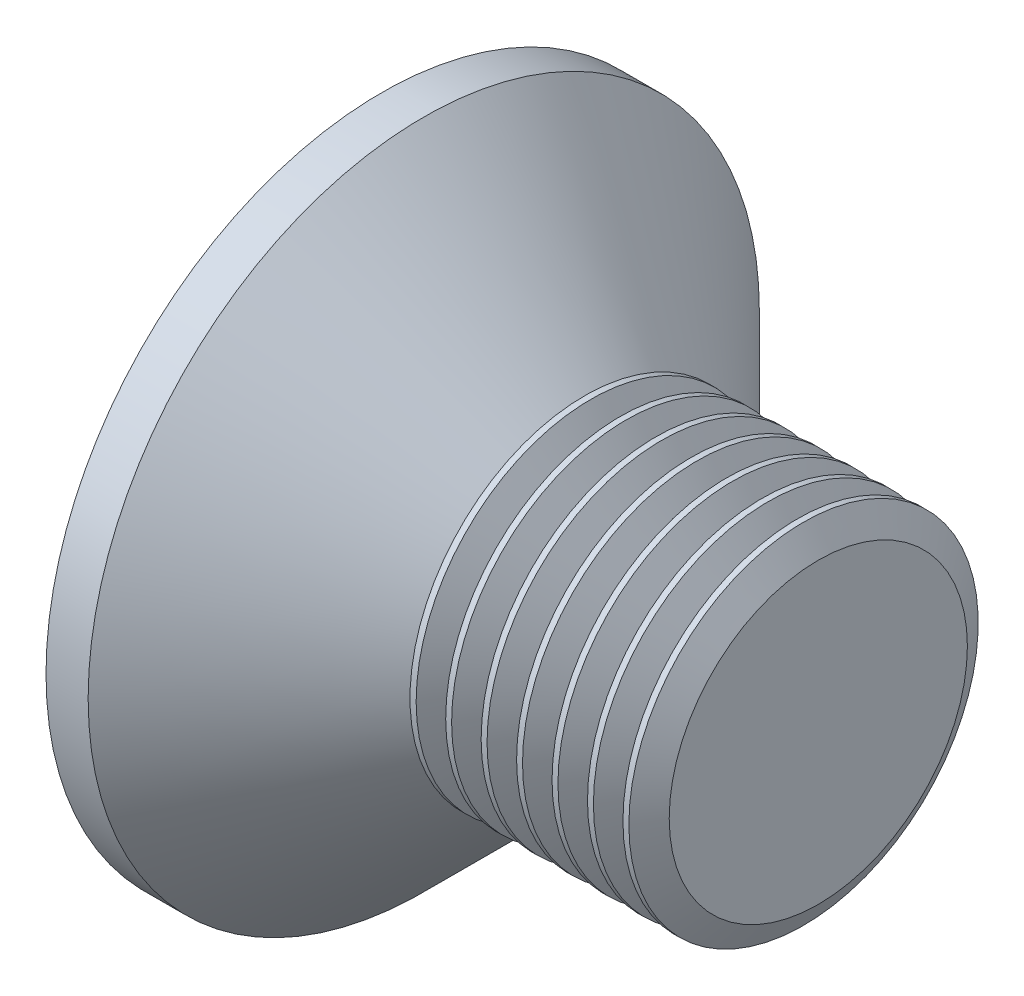
ISO-10303-21;
HEADER;
FILE_DESCRIPTION(('STEP AP214'),'2;1');
FILE_NAME('part.step','',(''),(''),'','','');
FILE_SCHEMA(('AUTOMOTIVE_DESIGN { 1 0 10303 214 1 1 1 1 }'));
ENDSEC;
DATA;
#1=APPLICATION_CONTEXT('core data for automotive mechanical design processes');
#2=APPLICATION_PROTOCOL_DEFINITION('international standard','automotive_design',2000,#1);
#3=PRODUCT_CONTEXT('',#1,'mechanical');
#4=PRODUCT('Part','Part','',(#3));
#5=PRODUCT_RELATED_PRODUCT_CATEGORY('part','',(#4));
#6=PRODUCT_DEFINITION_FORMATION('','',#4);
#7=PRODUCT_DEFINITION_CONTEXT('part definition',#1,'design');
#8=PRODUCT_DEFINITION('design','',#6,#7);
#9=PRODUCT_DEFINITION_SHAPE('','',#8);
#10=(LENGTH_UNIT() NAMED_UNIT(*) SI_UNIT(.MILLI.,.METRE.));
#11=(NAMED_UNIT(*) PLANE_ANGLE_UNIT() SI_UNIT($,.RADIAN.));
#12=(NAMED_UNIT(*) SI_UNIT($,.STERADIAN.) SOLID_ANGLE_UNIT());
#13=UNCERTAINTY_MEASURE_WITH_UNIT(LENGTH_MEASURE(1.E-05),#10,'distance_accuracy_value','');
#14=(GEOMETRIC_REPRESENTATION_CONTEXT(3) GLOBAL_UNCERTAINTY_ASSIGNED_CONTEXT((#13)) GLOBAL_UNIT_ASSIGNED_CONTEXT((#10,
#11,#12)) REPRESENTATION_CONTEXT('',''));
#15=CARTESIAN_POINT('',(0.,0.,0.));
#16=DIRECTION('',(0.,0.,1.));
#17=DIRECTION('',(1.,0.,0.));
#18=AXIS2_PLACEMENT_3D('',#15,#16,#17);
#19=CARTESIAN_POINT('',(4.51581291088132,0.,0.));
#20=DIRECTION('',(1.,0.,0.));
#21=DIRECTION('',(0.,0.,-1.));
#22=AXIS2_PLACEMENT_3D('',#19,#20,#21);
#23=CYLINDRICAL_SURFACE('',#22,3.99999999999999);
#24=CARTESIAN_POINT('',(5.60275,0.,0.));
#25=DIRECTION('',(-1.,0.,0.));
#26=DIRECTION('',(0.,0.,1.));
#27=AXIS2_PLACEMENT_3D('',#24,#25,#26);
#28=CIRCLE('',#27,4.);
#29=CARTESIAN_POINT('',(5.60275,0.,4.));
#30=VERTEX_POINT('',#29);
#31=EDGE_CURVE('E497',#30,#30,#28,.T.);
#32=ORIENTED_EDGE('',*,*,#31,.T.);
#33=EDGE_LOOP('',(#32));
#34=FACE_BOUND('',#33,.T.);
#35=CARTESIAN_POINT('',(5.46744999999999,0.,0.));
#36=DIRECTION('',(-1.,0.,0.));
#37=DIRECTION('',(0.,0.,1.));
#38=AXIS2_PLACEMENT_3D('',#35,#36,#37);
#39=CIRCLE('',#38,4.);
#40=CARTESIAN_POINT('',(5.46744999999999,0.,4.));
#41=VERTEX_POINT('',#40);
#42=EDGE_CURVE('E481',#41,#41,#39,.T.);
#43=ORIENTED_EDGE('',*,*,#42,.F.);
#44=EDGE_LOOP('',(#43));
#45=FACE_BOUND('',#44,.T.);
#46=ADVANCED_FACE('F32',(#34,#45),#23,.T.);
#47=CARTESIAN_POINT('',(6.41455,0.,0.));
#48=DIRECTION('',(-1.,0.,0.));
#49=DIRECTION('',(0.,0.,1.));
#50=AXIS2_PLACEMENT_3D('',#47,#48,#49);
#51=CIRCLE('',#50,4.);
#52=CARTESIAN_POINT('',(6.41455,0.,4.));
#53=VERTEX_POINT('',#52);
#54=EDGE_CURVE('E326',#53,#53,#51,.T.);
#55=ORIENTED_EDGE('',*,*,#54,.T.);
#56=EDGE_LOOP('',(#55));
#57=FACE_BOUND('',#56,.T.);
#58=CARTESIAN_POINT('',(6.27924999999999,0.,0.));
#59=DIRECTION('',(-1.,0.,0.));
#60=DIRECTION('',(0.,0.,1.));
#61=AXIS2_PLACEMENT_3D('',#58,#59,#60);
#62=CIRCLE('',#61,4.);
#63=CARTESIAN_POINT('',(6.27924999999999,0.,4.));
#64=VERTEX_POINT('',#63);
#65=EDGE_CURVE('E494',#64,#64,#62,.T.);
#66=ORIENTED_EDGE('',*,*,#65,.F.);
#67=EDGE_LOOP('',(#66));
#68=FACE_BOUND('',#67,.T.);
#69=ADVANCED_FACE('F239',(#57,#68),#23,.T.);
#70=CARTESIAN_POINT('',(7.22635,0.,0.));
#71=DIRECTION('',(-1.,0.,0.));
#72=DIRECTION('',(0.,0.,1.));
#73=AXIS2_PLACEMENT_3D('',#70,#71,#72);
#74=CIRCLE('',#73,4.);
#75=CARTESIAN_POINT('',(7.22635,0.,4.));
#76=VERTEX_POINT('',#75);
#77=EDGE_CURVE('E319',#76,#76,#74,.T.);
#78=ORIENTED_EDGE('',*,*,#77,.T.);
#79=EDGE_LOOP('',(#78));
#80=FACE_BOUND('',#79,.T.);
#81=CARTESIAN_POINT('',(7.09104999999999,0.,0.));
#82=DIRECTION('',(-1.,0.,0.));
#83=DIRECTION('',(0.,0.,1.));
#84=AXIS2_PLACEMENT_3D('',#81,#82,#83);
#85=CIRCLE('',#84,4.);
#86=CARTESIAN_POINT('',(7.09104999999999,0.,4.));
#87=VERTEX_POINT('',#86);
#88=EDGE_CURVE('E502',#87,#87,#85,.T.);
#89=ORIENTED_EDGE('',*,*,#88,.F.);
#90=EDGE_LOOP('',(#89));
#91=FACE_BOUND('',#90,.T.);
#92=ADVANCED_FACE('F247',(#80,#91),#23,.T.);
#93=CARTESIAN_POINT('',(8.03815,0.,0.));
#94=DIRECTION('',(-1.,0.,0.));
#95=DIRECTION('',(0.,0.,1.));
#96=AXIS2_PLACEMENT_3D('',#93,#94,#95);
#97=CIRCLE('',#96,4.);
#98=CARTESIAN_POINT('',(8.03815,0.,4.));
#99=VERTEX_POINT('',#98);
#100=EDGE_CURVE('E314',#99,#99,#97,.T.);
#101=ORIENTED_EDGE('',*,*,#100,.T.);
#102=EDGE_LOOP('',(#101));
#103=FACE_BOUND('',#102,.T.);
#104=CARTESIAN_POINT('',(7.90284999999999,0.,0.));
#105=DIRECTION('',(-1.,0.,0.));
#106=DIRECTION('',(0.,0.,1.));
#107=AXIS2_PLACEMENT_3D('',#104,#105,#106);
#108=CIRCLE('',#107,4.);
#109=CARTESIAN_POINT('',(7.90284999999999,0.,4.));
#110=VERTEX_POINT('',#109);
#111=EDGE_CURVE('E317',#110,#110,#108,.T.);
#112=ORIENTED_EDGE('',*,*,#111,.F.);
#113=EDGE_LOOP('',(#112));
#114=FACE_BOUND('',#113,.T.);
#115=ADVANCED_FACE('F285',(#103,#114),#23,.T.);
#116=CARTESIAN_POINT('',(8.03815,0.,0.));
#117=DIRECTION('',(-1.,0.,0.));
#118=DIRECTION('',(0.,0.,1.));
#119=AXIS2_PLACEMENT_3D('',#116,#117,#118);
#120=CONICAL_SURFACE('',#119,4.,1.0471975511966);
#121=CARTESIAN_POINT('',(8.37639999999999,0.,0.));
#122=DIRECTION('',(-1.,0.,0.));
#123=DIRECTION('',(0.,0.,1.));
#124=AXIS2_PLACEMENT_3D('',#121,#122,#123);
#125=CIRCLE('',#124,3.41413381433983);
#126=CARTESIAN_POINT('',(8.37639999999999,0.,3.41413381433983));
#127=VERTEX_POINT('',#126);
#128=EDGE_CURVE('E323',#127,#127,#125,.T.);
#129=ORIENTED_EDGE('',*,*,#128,.T.);
#130=EDGE_LOOP('',(#129));
#131=FACE_BOUND('',#130,.T.);
#132=ORIENTED_EDGE('',*,*,#100,.F.);
#133=EDGE_LOOP('',(#132));
#134=FACE_BOUND('',#133,.T.);
#135=ADVANCED_FACE('F300',(#131,#134),#120,.T.);
#136=CARTESIAN_POINT('',(8.37639999999999,0.,0.));
#137=DIRECTION('',(1.,0.,0.));
#138=DIRECTION('',(0.,0.,-1.));
#139=AXIS2_PLACEMENT_3D('',#136,#137,#138);
#140=CONICAL_SURFACE('',#139,3.41413381433983,1.0471975511966);
#141=CARTESIAN_POINT('',(8.71464999999999,0.,0.));
#142=DIRECTION('',(-1.,0.,0.));
#143=DIRECTION('',(0.,0.,1.));
#144=AXIS2_PLACEMENT_3D('',#141,#142,#143);
#145=CIRCLE('',#144,4.);
#146=CARTESIAN_POINT('',(8.71464999999999,0.,4.));
#147=VERTEX_POINT('',#146);
#148=EDGE_CURVE('E332',#147,#147,#145,.T.);
#149=ORIENTED_EDGE('',*,*,#148,.T.);
#150=EDGE_LOOP('',(#149));
#151=FACE_BOUND('',#150,.T.);
#152=ORIENTED_EDGE('',*,*,#128,.F.);
#153=EDGE_LOOP('',(#152));
#154=FACE_BOUND('',#153,.T.);
#155=ADVANCED_FACE('F307',(#151,#154),#140,.T.);
#156=CARTESIAN_POINT('',(10.,3.99999999999999,0.));
#157=DIRECTION('',(1.,0.,0.));
#158=DIRECTION('',(0.,0.,-1.));
#159=AXIS2_PLACEMENT_3D('',#156,#157,#158);
#160=PLANE('',#159);
#161=CARTESIAN_POINT('',(9.99999999999999,0.,0.));
#162=DIRECTION('',(-1.,0.,0.));
#163=DIRECTION('',(0.,0.,1.));
#164=AXIS2_PLACEMENT_3D('',#161,#162,#163);
#165=CIRCLE('',#164,3.41413381433983);
#166=CARTESIAN_POINT('',(9.99999999999999,0.,3.41413381433983));
#167=VERTEX_POINT('',#166);
#168=EDGE_CURVE('E344',#167,#167,#165,.T.);
#169=ORIENTED_EDGE('',*,*,#168,.F.);
#170=EDGE_LOOP('',(#169));
#171=FACE_BOUND('',#170,.T.);
#172=ADVANCED_FACE('F277',(#171),#160,.T.);
#173=CARTESIAN_POINT('',(9.66175,0.,0.));
#174=DIRECTION('',(-1.,0.,0.));
#175=DIRECTION('',(0.,0.,1.));
#176=AXIS2_PLACEMENT_3D('',#173,#174,#175);
#177=CONICAL_SURFACE('',#176,4.,1.0471975511966);
#178=ORIENTED_EDGE('',*,*,#168,.T.);
#179=EDGE_LOOP('',(#178));
#180=FACE_BOUND('',#179,.T.);
#181=CARTESIAN_POINT('',(9.66175,0.,0.));
#182=DIRECTION('',(-1.,0.,0.));
#183=DIRECTION('',(0.,0.,1.));
#184=AXIS2_PLACEMENT_3D('',#181,#182,#183);
#185=CIRCLE('',#184,4.);
#186=CARTESIAN_POINT('',(9.66175,0.,4.));
#187=VERTEX_POINT('',#186);
#188=EDGE_CURVE('E156',#187,#187,#185,.T.);
#189=ORIENTED_EDGE('',*,*,#188,.F.);
#190=EDGE_LOOP('',(#189));
#191=FACE_BOUND('',#190,.T.);
#192=ADVANCED_FACE('F265',(#180,#191),#177,.T.);
#193=ORIENTED_EDGE('',*,*,#188,.T.);
#194=EDGE_LOOP('',(#193));
#195=FACE_BOUND('',#194,.T.);
#196=CARTESIAN_POINT('',(9.52644999999999,0.,0.));
#197=DIRECTION('',(-1.,0.,0.));
#198=DIRECTION('',(0.,0.,1.));
#199=AXIS2_PLACEMENT_3D('',#196,#197,#198);
#200=CIRCLE('',#199,4.);
#201=CARTESIAN_POINT('',(9.52644999999999,0.,4.));
#202=VERTEX_POINT('',#201);
#203=EDGE_CURVE('E339',#202,#202,#200,.T.);
#204=ORIENTED_EDGE('',*,*,#203,.F.);
#205=EDGE_LOOP('',(#204));
#206=FACE_BOUND('',#205,.T.);
#207=ADVANCED_FACE('F255',(#195,#206),#23,.T.);
#208=CARTESIAN_POINT('',(9.18819999999999,0.,0.));
#209=DIRECTION('',(1.,0.,0.));
#210=DIRECTION('',(0.,0.,-1.));
#211=AXIS2_PLACEMENT_3D('',#208,#209,#210);
#212=CONICAL_SURFACE('',#211,3.41413381433983,1.0471975511966);
#213=ORIENTED_EDGE('',*,*,#203,.T.);
#214=EDGE_LOOP('',(#213));
#215=FACE_BOUND('',#214,.T.);
#216=CARTESIAN_POINT('',(9.18819999999999,0.,0.));
#217=DIRECTION('',(-1.,0.,0.));
#218=DIRECTION('',(0.,0.,1.));
#219=AXIS2_PLACEMENT_3D('',#216,#217,#218);
#220=CIRCLE('',#219,3.41413381433983);
#221=CARTESIAN_POINT('',(9.18819999999999,0.,3.41413381433983));
#222=VERTEX_POINT('',#221);
#223=EDGE_CURVE('E336',#222,#222,#220,.T.);
#224=ORIENTED_EDGE('',*,*,#223,.F.);
#225=EDGE_LOOP('',(#224));
#226=FACE_BOUND('',#225,.T.);
#227=ADVANCED_FACE('F264',(#215,#226),#212,.T.);
#228=CARTESIAN_POINT('',(8.84995,0.,0.));
#229=DIRECTION('',(-1.,0.,0.));
#230=DIRECTION('',(0.,0.,1.));
#231=AXIS2_PLACEMENT_3D('',#228,#229,#230);
#232=CONICAL_SURFACE('',#231,4.,1.0471975511966);
#233=ORIENTED_EDGE('',*,*,#223,.T.);
#234=EDGE_LOOP('',(#233));
#235=FACE_BOUND('',#234,.T.);
#236=CARTESIAN_POINT('',(8.84995,0.,0.));
#237=DIRECTION('',(-1.,0.,0.));
#238=DIRECTION('',(0.,0.,1.));
#239=AXIS2_PLACEMENT_3D('',#236,#237,#238);
#240=CIRCLE('',#239,4.);
#241=CARTESIAN_POINT('',(8.84995,0.,4.));
#242=VERTEX_POINT('',#241);
#243=EDGE_CURVE('E342',#242,#242,#240,.T.);
#244=ORIENTED_EDGE('',*,*,#243,.F.);
#245=EDGE_LOOP('',(#244));
#246=FACE_BOUND('',#245,.T.);
#247=ADVANCED_FACE('F273',(#235,#246),#232,.T.);
#248=ORIENTED_EDGE('',*,*,#243,.T.);
#249=EDGE_LOOP('',(#248));
#250=FACE_BOUND('',#249,.T.);
#251=ORIENTED_EDGE('',*,*,#148,.F.);
#252=EDGE_LOOP('',(#251));
#253=FACE_BOUND('',#252,.T.);
#254=ADVANCED_FACE('F267',(#250,#253),#23,.T.);
#255=CARTESIAN_POINT('',(7.22635,0.,0.));
#256=DIRECTION('',(-1.,0.,0.));
#257=DIRECTION('',(0.,0.,1.));
#258=AXIS2_PLACEMENT_3D('',#255,#256,#257);
#259=CONICAL_SURFACE('',#258,4.,1.0471975511966);
#260=CARTESIAN_POINT('',(7.5646,0.,0.));
#261=DIRECTION('',(-1.,0.,0.));
#262=DIRECTION('',(0.,0.,1.));
#263=AXIS2_PLACEMENT_3D('',#260,#261,#262);
#264=CIRCLE('',#263,3.41413381433983);
#265=CARTESIAN_POINT('',(7.5646,0.,3.41413381433983));
#266=VERTEX_POINT('',#265);
#267=EDGE_CURVE('E320',#266,#266,#264,.T.);
#268=ORIENTED_EDGE('',*,*,#267,.T.);
#269=EDGE_LOOP('',(#268));
#270=FACE_BOUND('',#269,.T.);
#271=ORIENTED_EDGE('',*,*,#77,.F.);
#272=EDGE_LOOP('',(#271));
#273=FACE_BOUND('',#272,.T.);
#274=ADVANCED_FACE('F283',(#270,#273),#259,.T.);
#275=CARTESIAN_POINT('',(7.5646,0.,0.));
#276=DIRECTION('',(1.,0.,0.));
#277=DIRECTION('',(0.,0.,-1.));
#278=AXIS2_PLACEMENT_3D('',#275,#276,#277);
#279=CONICAL_SURFACE('',#278,3.41413381433983,1.0471975511966);
#280=ORIENTED_EDGE('',*,*,#111,.T.);
#281=EDGE_LOOP('',(#280));
#282=FACE_BOUND('',#281,.T.);
#283=ORIENTED_EDGE('',*,*,#267,.F.);
#284=EDGE_LOOP('',(#283));
#285=FACE_BOUND('',#284,.T.);
#286=ADVANCED_FACE('F291',(#282,#285),#279,.T.);
#287=CARTESIAN_POINT('',(6.41455,0.,0.));
#288=DIRECTION('',(-1.,0.,0.));
#289=DIRECTION('',(0.,0.,1.));
#290=AXIS2_PLACEMENT_3D('',#287,#288,#289);
#291=CONICAL_SURFACE('',#290,4.,1.0471975511966);
#292=CARTESIAN_POINT('',(6.7528,0.,0.));
#293=DIRECTION('',(-1.,0.,0.));
#294=DIRECTION('',(0.,0.,1.));
#295=AXIS2_PLACEMENT_3D('',#292,#293,#294);
#296=CIRCLE('',#295,3.41413381433983);
#297=CARTESIAN_POINT('',(6.7528,0.,3.41413381433983));
#298=VERTEX_POINT('',#297);
#299=EDGE_CURVE('E499',#298,#298,#296,.T.);
#300=ORIENTED_EDGE('',*,*,#299,.T.);
#301=EDGE_LOOP('',(#300));
#302=FACE_BOUND('',#301,.T.);
#303=ORIENTED_EDGE('',*,*,#54,.F.);
#304=EDGE_LOOP('',(#303));
#305=FACE_BOUND('',#304,.T.);
#306=ADVANCED_FACE('F455',(#302,#305),#291,.T.);
#307=CARTESIAN_POINT('',(6.7528,0.,0.));
#308=DIRECTION('',(1.,0.,0.));
#309=DIRECTION('',(0.,0.,-1.));
#310=AXIS2_PLACEMENT_3D('',#307,#308,#309);
#311=CONICAL_SURFACE('',#310,3.41413381433983,1.0471975511966);
#312=ORIENTED_EDGE('',*,*,#88,.T.);
#313=EDGE_LOOP('',(#312));
#314=FACE_BOUND('',#313,.T.);
#315=ORIENTED_EDGE('',*,*,#299,.F.);
#316=EDGE_LOOP('',(#315));
#317=FACE_BOUND('',#316,.T.);
#318=ADVANCED_FACE('F458',(#314,#317),#311,.T.);
#319=CARTESIAN_POINT('',(5.60275,0.,0.));
#320=DIRECTION('',(-1.,0.,0.));
#321=DIRECTION('',(0.,0.,1.));
#322=AXIS2_PLACEMENT_3D('',#319,#320,#321);
#323=CONICAL_SURFACE('',#322,4.,1.0471975511966);
#324=CARTESIAN_POINT('',(5.941,0.,0.));
#325=DIRECTION('',(-1.,0.,0.));
#326=DIRECTION('',(0.,0.,1.));
#327=AXIS2_PLACEMENT_3D('',#324,#325,#326);
#328=CIRCLE('',#327,3.41413381433983);
#329=CARTESIAN_POINT('',(5.941,0.,3.41413381433983));
#330=VERTEX_POINT('',#329);
#331=EDGE_CURVE('E491',#330,#330,#328,.T.);
#332=ORIENTED_EDGE('',*,*,#331,.T.);
#333=EDGE_LOOP('',(#332));
#334=FACE_BOUND('',#333,.T.);
#335=ORIENTED_EDGE('',*,*,#31,.F.);
#336=EDGE_LOOP('',(#335));
#337=FACE_BOUND('',#336,.T.);
#338=ADVANCED_FACE('F462',(#334,#337),#323,.T.);
#339=CARTESIAN_POINT('',(5.941,0.,0.));
#340=DIRECTION('',(1.,0.,0.));
#341=DIRECTION('',(0.,0.,-1.));
#342=AXIS2_PLACEMENT_3D('',#339,#340,#341);
#343=CONICAL_SURFACE('',#342,3.41413381433983,1.0471975511966);
#344=ORIENTED_EDGE('',*,*,#65,.T.);
#345=EDGE_LOOP('',(#344));
#346=FACE_BOUND('',#345,.T.);
#347=ORIENTED_EDGE('',*,*,#331,.F.);
#348=EDGE_LOOP('',(#347));
#349=FACE_BOUND('',#348,.T.);
#350=ADVANCED_FACE('F466',(#346,#349),#343,.T.);
#351=CARTESIAN_POINT('',(4.79095,0.,0.));
#352=DIRECTION('',(-1.,0.,0.));
#353=DIRECTION('',(0.,0.,1.));
#354=AXIS2_PLACEMENT_3D('',#351,#352,#353);
#355=CONICAL_SURFACE('',#354,4.,1.0471975511966);
#356=CARTESIAN_POINT('',(5.1292,0.,0.));
#357=DIRECTION('',(-1.,0.,0.));
#358=DIRECTION('',(0.,0.,1.));
#359=AXIS2_PLACEMENT_3D('',#356,#357,#358);
#360=CIRCLE('',#359,3.41413381433983);
#361=CARTESIAN_POINT('',(5.1292,0.,3.41413381433983));
#362=VERTEX_POINT('',#361);
#363=EDGE_CURVE('E484',#362,#362,#360,.T.);
#364=ORIENTED_EDGE('',*,*,#363,.T.);
#365=EDGE_LOOP('',(#364));
#366=FACE_BOUND('',#365,.T.);
#367=CARTESIAN_POINT('',(4.79095,0.,0.));
#368=DIRECTION('',(-1.,0.,0.));
#369=DIRECTION('',(0.,0.,1.));
#370=AXIS2_PLACEMENT_3D('',#367,#368,#369);
#371=CIRCLE('',#370,4.);
#372=CARTESIAN_POINT('',(4.79095,0.,4.));
#373=VERTEX_POINT('',#372);
#374=EDGE_CURVE('E486',#373,#373,#371,.T.);
#375=ORIENTED_EDGE('',*,*,#374,.F.);
#376=EDGE_LOOP('',(#375));
#377=FACE_BOUND('',#376,.T.);
#378=ADVANCED_FACE('F470',(#366,#377),#355,.T.);
#379=CARTESIAN_POINT('',(5.1292,0.,0.));
#380=DIRECTION('',(1.,0.,0.));
#381=DIRECTION('',(0.,0.,-1.));
#382=AXIS2_PLACEMENT_3D('',#379,#380,#381);
#383=CONICAL_SURFACE('',#382,3.41413381433983,1.0471975511966);
#384=ORIENTED_EDGE('',*,*,#42,.T.);
#385=EDGE_LOOP('',(#384));
#386=FACE_BOUND('',#385,.T.);
#387=ORIENTED_EDGE('',*,*,#363,.F.);
#388=EDGE_LOOP('',(#387));
#389=FACE_BOUND('',#388,.T.);
#390=ADVANCED_FACE('F448',(#386,#389),#383,.T.);
#391=CARTESIAN_POINT('',(2.325,0.89,0.89));
#392=DIRECTION('',(1.,0.,0.));
#393=DIRECTION('',(0.,0.,-1.));
#394=AXIS2_PLACEMENT_3D('',#391,#392,#393);
#395=PLANE('',#394);
#396=DIRECTION('',(0.,0.,1.));
#397=VECTOR('',#396,1.);
#398=CARTESIAN_POINT('',(2.325,0.89,0.89));
#399=LINE('',#398,#397);
#400=CARTESIAN_POINT('',(2.325,0.89,1.19));
#401=VERTEX_POINT('',#400);
#402=CARTESIAN_POINT('',(2.325,0.889999999999999,3.10766062413412));
#403=VERTEX_POINT('',#402);
#404=EDGE_CURVE('E169',#401,#403,#399,.T.);
#405=ORIENTED_EDGE('',*,*,#404,.F.);
#406=CARTESIAN_POINT('',(2.325,1.19,1.19));
#407=DIRECTION('',(1.,0.,0.));
#408=DIRECTION('',(0.,0.,-1.));
#409=AXIS2_PLACEMENT_3D('',#406,#407,#408);
#410=CIRCLE('',#409,0.3);
#411=CARTESIAN_POINT('',(2.325,1.19,0.89));
#412=VERTEX_POINT('',#411);
#413=EDGE_CURVE('E40',#401,#412,#410,.T.);
#414=ORIENTED_EDGE('',*,*,#413,.T.);
#415=DIRECTION('',(0.,-1.,0.));
#416=VECTOR('',#415,1.);
#417=CARTESIAN_POINT('',(2.325,0.89,0.89));
#418=LINE('',#417,#416);
#419=CARTESIAN_POINT('',(2.325,3.10766062413412,0.89));
#420=VERTEX_POINT('',#419);
#421=EDGE_CURVE('E216',#420,#412,#418,.T.);
#422=ORIENTED_EDGE('',*,*,#421,.F.);
#423=DIRECTION('',(0.,0.,1.));
#424=VECTOR('',#423,1.);
#425=CARTESIAN_POINT('',(2.325,3.10766062413412,-0.89));
#426=LINE('',#425,#424);
#427=CARTESIAN_POINT('',(2.325,3.10766062413412,-0.89));
#428=VERTEX_POINT('',#427);
#429=EDGE_CURVE('E224',#428,#420,#426,.T.);
#430=ORIENTED_EDGE('',*,*,#429,.F.);
#431=DIRECTION('',(0.,1.,0.));
#432=VECTOR('',#431,1.);
#433=CARTESIAN_POINT('',(2.325,0.89,-0.89));
#434=LINE('',#433,#432);
#435=CARTESIAN_POINT('',(2.325,1.19,-0.89));
#436=VERTEX_POINT('',#435);
#437=EDGE_CURVE('E364',#436,#428,#434,.T.);
#438=ORIENTED_EDGE('',*,*,#437,.F.);
#439=CARTESIAN_POINT('',(2.325,1.19,-1.19));
#440=DIRECTION('',(1.,0.,0.));
#441=DIRECTION('',(0.,0.,-1.));
#442=AXIS2_PLACEMENT_3D('',#439,#440,#441);
#443=CIRCLE('',#442,0.3);
#444=CARTESIAN_POINT('',(2.325,0.89,-1.19));
#445=VERTEX_POINT('',#444);
#446=EDGE_CURVE('E210',#436,#445,#443,.T.);
#447=ORIENTED_EDGE('',*,*,#446,.T.);
#448=DIRECTION('',(0.,0.,1.));
#449=VECTOR('',#448,1.);
#450=CARTESIAN_POINT('',(2.325,0.89,-0.89));
#451=LINE('',#450,#449);
#452=CARTESIAN_POINT('',(2.325,0.89,-3.10766062413412));
#453=VERTEX_POINT('',#452);
#454=EDGE_CURVE('E361',#453,#445,#451,.T.);
#455=ORIENTED_EDGE('',*,*,#454,.F.);
#456=DIRECTION('',(0.,1.,0.));
#457=VECTOR('',#456,1.);
#458=CARTESIAN_POINT('',(2.325,0.89,-3.10766062413412));
#459=LINE('',#458,#457);
#460=CARTESIAN_POINT('',(2.325,-0.89,-3.10766062413412));
#461=VERTEX_POINT('',#460);
#462=EDGE_CURVE('E360',#461,#453,#459,.T.);
#463=ORIENTED_EDGE('',*,*,#462,.F.);
#464=DIRECTION('',(0.,0.,-1.));
#465=VECTOR('',#464,1.);
#466=CARTESIAN_POINT('',(2.325,-0.89,-0.89));
#467=LINE('',#466,#465);
#468=CARTESIAN_POINT('',(2.325,-0.89,-1.19));
#469=VERTEX_POINT('',#468);
#470=EDGE_CURVE('E358',#469,#461,#467,.T.);
#471=ORIENTED_EDGE('',*,*,#470,.F.);
#472=CARTESIAN_POINT('',(2.325,-1.19,-1.19));
#473=DIRECTION('',(1.,0.,0.));
#474=DIRECTION('',(0.,0.,-1.));
#475=AXIS2_PLACEMENT_3D('',#472,#473,#474);
#476=CIRCLE('',#475,0.3);
#477=CARTESIAN_POINT('',(2.325,-1.19,-0.89));
#478=VERTEX_POINT('',#477);
#479=EDGE_CURVE('E208',#469,#478,#476,.T.);
#480=ORIENTED_EDGE('',*,*,#479,.T.);
#481=DIRECTION('',(0.,1.,0.));
#482=VECTOR('',#481,1.);
#483=CARTESIAN_POINT('',(2.325,-0.89,-0.89));
#484=LINE('',#483,#482);
#485=CARTESIAN_POINT('',(2.325,-3.10766062413412,-0.89));
#486=VERTEX_POINT('',#485);
#487=EDGE_CURVE('E355',#486,#478,#484,.T.);
#488=ORIENTED_EDGE('',*,*,#487,.F.);
#489=DIRECTION('',(0.,0.,-1.));
#490=VECTOR('',#489,1.);
#491=CARTESIAN_POINT('',(2.325,-3.10766062413412,-0.89));
#492=LINE('',#491,#490);
#493=CARTESIAN_POINT('',(2.325,-3.10766062413412,0.889999999999999));
#494=VERTEX_POINT('',#493);
#495=EDGE_CURVE('E354',#494,#486,#492,.T.);
#496=ORIENTED_EDGE('',*,*,#495,.F.);
#497=DIRECTION('',(0.,-1.,0.));
#498=VECTOR('',#497,1.);
#499=CARTESIAN_POINT('',(2.325,-0.89,0.89));
#500=LINE('',#499,#498);
#501=CARTESIAN_POINT('',(2.325,-1.19,0.889999999999999));
#502=VERTEX_POINT('',#501);
#503=EDGE_CURVE('E352',#502,#494,#500,.T.);
#504=ORIENTED_EDGE('',*,*,#503,.F.);
#505=CARTESIAN_POINT('',(2.325,-1.19,1.19));
#506=DIRECTION('',(1.,0.,0.));
#507=DIRECTION('',(0.,0.,-1.));
#508=AXIS2_PLACEMENT_3D('',#505,#506,#507);
#509=CIRCLE('',#508,0.3);
#510=CARTESIAN_POINT('',(2.325,-0.89,1.19));
#511=VERTEX_POINT('',#510);
#512=EDGE_CURVE('E11',#502,#511,#509,.T.);
#513=ORIENTED_EDGE('',*,*,#512,.T.);
#514=DIRECTION('',(0.,0.,-1.));
#515=VECTOR('',#514,1.);
#516=CARTESIAN_POINT('',(2.325,-0.89,0.89));
#517=LINE('',#516,#515);
#518=CARTESIAN_POINT('',(2.325,-0.890000000000001,3.10766062413412));
#519=VERTEX_POINT('',#518);
#520=EDGE_CURVE('E350',#519,#511,#517,.T.);
#521=ORIENTED_EDGE('',*,*,#520,.F.);
#522=DIRECTION('',(0.,-1.,0.));
#523=VECTOR('',#522,1.);
#524=CARTESIAN_POINT('',(2.325,0.889999999999999,3.10766062413412));
#525=LINE('',#524,#523);
#526=EDGE_CURVE('E180',#403,#519,#525,.T.);
#527=ORIENTED_EDGE('',*,*,#526,.F.);
#528=EDGE_LOOP('',(#405,#414,#422,#430,#438,#447,#455,#463,#471,#480,#488,#496,#504,#513,#521,#527));
#529=FACE_BOUND('',#528,.T.);
#530=ADVANCED_FACE('F214',(#529),#395,.F.);
#531=CARTESIAN_POINT('',(0.,-4.45,-0.89));
#532=DIRECTION('',(-0.500000000000001,0.866025403784438,0.));
#533=DIRECTION('',(-0.866025403784438,-0.500000000000001,0.));
#534=AXIS2_PLACEMENT_3D('',#531,#532,#533);
#535=PLANE('',#534);
#536=DIRECTION('',(0.,0.,-1.));
#537=VECTOR('',#536,1.);
#538=CARTESIAN_POINT('',(0.,-4.45,-0.89));
#539=LINE('',#538,#537);
#540=CARTESIAN_POINT('',(0.,-4.45,0.889999999999999));
#541=VERTEX_POINT('',#540);
#542=CARTESIAN_POINT('',(0.,-4.45,-0.89));
#543=VERTEX_POINT('',#542);
#544=EDGE_CURVE('E369',#541,#543,#539,.T.);
#545=ORIENTED_EDGE('',*,*,#544,.F.);
#546=DIRECTION('',(-0.866025403784438,-0.500000000000001,0.));
#547=VECTOR('',#546,1.);
#548=CARTESIAN_POINT('',(0.,-4.45,0.889999999999999));
#549=LINE('',#548,#547);
#550=EDGE_CURVE('E176',#494,#541,#549,.T.);
#551=ORIENTED_EDGE('',*,*,#550,.F.);
#552=ORIENTED_EDGE('',*,*,#495,.T.);
#553=DIRECTION('',(-0.866025403784438,-0.500000000000001,0.));
#554=VECTOR('',#553,1.);
#555=CARTESIAN_POINT('',(3.2852752187363,-2.55324546810058,-0.89));
#556=LINE('',#555,#554);
#557=EDGE_CURVE('E403',#486,#543,#556,.T.);
#558=ORIENTED_EDGE('',*,*,#557,.T.);
#559=EDGE_LOOP('',(#545,#551,#552,#558));
#560=FACE_BOUND('',#559,.T.);
#561=ADVANCED_FACE('F412',(#560),#535,.T.);
#562=CARTESIAN_POINT('',(2.325,-0.89,0.89));
#563=DIRECTION('',(0.,0.,-1.));
#564=DIRECTION('',(0.,1.,0.));
#565=AXIS2_PLACEMENT_3D('',#562,#563,#564);
#566=PLANE('',#565);
#567=DIRECTION('',(0.,-1.,0.));
#568=VECTOR('',#567,1.);
#569=CARTESIAN_POINT('',(0.,-0.89,0.89));
#570=LINE('',#569,#568);
#571=CARTESIAN_POINT('',(0.,-1.19,0.889999999999999));
#572=VERTEX_POINT('',#571);
#573=EDGE_CURVE('E367',#572,#541,#570,.T.);
#574=ORIENTED_EDGE('',*,*,#573,.F.);
#575=DIRECTION('',(-1.,0.,0.));
#576=VECTOR('',#575,1.);
#577=CARTESIAN_POINT('',(2.325,-1.19,0.889999999999999));
#578=LINE('',#577,#576);
#579=EDGE_CURVE('E47',#572,#502,#578,.F.);
#580=ORIENTED_EDGE('',*,*,#579,.T.);
#581=ORIENTED_EDGE('',*,*,#503,.T.);
#582=ORIENTED_EDGE('',*,*,#550,.T.);
#583=EDGE_LOOP('',(#574,#580,#581,#582));
#584=FACE_BOUND('',#583,.T.);
#585=ADVANCED_FACE('F409',(#584),#566,.T.);
#586=CARTESIAN_POINT('',(2.325,-1.19,1.19));
#587=DIRECTION('',(-1.,0.,0.));
#588=DIRECTION('',(0.,0.,1.));
#589=AXIS2_PLACEMENT_3D('',#586,#587,#588);
#590=CYLINDRICAL_SURFACE('',#589,0.3);
#591=ORIENTED_EDGE('',*,*,#512,.F.);
#592=ORIENTED_EDGE('',*,*,#579,.F.);
#593=CARTESIAN_POINT('',(0.,-1.19,1.19));
#594=DIRECTION('',(-1.,0.,0.));
#595=DIRECTION('',(0.,0.,1.));
#596=AXIS2_PLACEMENT_3D('',#593,#594,#595);
#597=CIRCLE('',#596,0.3);
#598=CARTESIAN_POINT('',(0.,-0.89,1.19));
#599=VERTEX_POINT('',#598);
#600=EDGE_CURVE('E184',#599,#572,#597,.T.);
#601=ORIENTED_EDGE('',*,*,#600,.F.);
#602=DIRECTION('',(-1.,0.,0.));
#603=VECTOR('',#602,1.);
#604=CARTESIAN_POINT('',(2.325,-0.89,1.19));
#605=LINE('',#604,#603);
#606=EDGE_CURVE('E204',#511,#599,#605,.T.);
#607=ORIENTED_EDGE('',*,*,#606,.F.);
#608=EDGE_LOOP('',(#591,#592,#601,#607));
#609=FACE_BOUND('',#608,.T.);
#610=ADVANCED_FACE('F34',(#609),#590,.T.);
#611=CARTESIAN_POINT('',(2.325,-0.89,0.89));
#612=DIRECTION('',(0.,1.,0.));
#613=DIRECTION('',(0.,0.,1.));
#614=AXIS2_PLACEMENT_3D('',#611,#612,#613);
#615=PLANE('',#614);
#616=ORIENTED_EDGE('',*,*,#520,.T.);
#617=ORIENTED_EDGE('',*,*,#606,.T.);
#618=DIRECTION('',(0.,0.,-1.));
#619=VECTOR('',#618,1.);
#620=CARTESIAN_POINT('',(0.,-0.89,0.89));
#621=LINE('',#620,#619);
#622=CARTESIAN_POINT('',(0.,-0.890000000000001,4.45));
#623=VERTEX_POINT('',#622);
#624=EDGE_CURVE('E165',#623,#599,#621,.T.);
#625=ORIENTED_EDGE('',*,*,#624,.F.);
#626=DIRECTION('',(-0.866025403784438,0.,0.500000000000001));
#627=VECTOR('',#626,1.);
#628=CARTESIAN_POINT('',(3.2852752187363,-0.890000000000001,2.55324546810059));
#629=LINE('',#628,#627);
#630=EDGE_CURVE('E163',#519,#623,#629,.T.);
#631=ORIENTED_EDGE('',*,*,#630,.F.);
#632=EDGE_LOOP('',(#616,#617,#625,#631));
#633=FACE_BOUND('',#632,.T.);
#634=ADVANCED_FACE('F418',(#633),#615,.T.);
#635=CARTESIAN_POINT('',(0.,0.889999999999999,4.45));
#636=DIRECTION('',(-0.500000000000001,0.,-0.866025403784438));
#637=DIRECTION('',(-0.866025403784438,0.,0.500000000000001));
#638=AXIS2_PLACEMENT_3D('',#635,#636,#637);
#639=PLANE('',#638);
#640=DIRECTION('',(0.,-1.,0.));
#641=VECTOR('',#640,1.);
#642=CARTESIAN_POINT('',(0.,0.889999999999999,4.45));
#643=LINE('',#642,#641);
#644=CARTESIAN_POINT('',(0.,0.889999999999999,4.45));
#645=VERTEX_POINT('',#644);
#646=EDGE_CURVE('E150',#645,#623,#643,.T.);
#647=ORIENTED_EDGE('',*,*,#646,.F.);
#648=DIRECTION('',(-0.866025403784438,0.,0.500000000000001));
#649=VECTOR('',#648,1.);
#650=CARTESIAN_POINT('',(0.,0.889999999999999,4.45));
#651=LINE('',#650,#649);
#652=EDGE_CURVE('E161',#403,#645,#651,.T.);
#653=ORIENTED_EDGE('',*,*,#652,.F.);
#654=ORIENTED_EDGE('',*,*,#526,.T.);
#655=ORIENTED_EDGE('',*,*,#630,.T.);
#656=EDGE_LOOP('',(#647,#653,#654,#655));
#657=FACE_BOUND('',#656,.T.);
#658=ADVANCED_FACE('F160',(#657),#639,.T.);
#659=CARTESIAN_POINT('',(2.325,0.89,0.89));
#660=DIRECTION('',(0.,-1.,0.));
#661=DIRECTION('',(0.,0.,-1.));
#662=AXIS2_PLACEMENT_3D('',#659,#660,#661);
#663=PLANE('',#662);
#664=DIRECTION('',(0.,0.,1.));
#665=VECTOR('',#664,1.);
#666=CARTESIAN_POINT('',(0.,0.89,0.89));
#667=LINE('',#666,#665);
#668=CARTESIAN_POINT('',(0.,0.89,1.19));
#669=VERTEX_POINT('',#668);
#670=EDGE_CURVE('E145',#669,#645,#667,.T.);
#671=ORIENTED_EDGE('',*,*,#670,.F.);
#672=DIRECTION('',(-1.,0.,0.));
#673=VECTOR('',#672,1.);
#674=CARTESIAN_POINT('',(2.325,0.89,1.19));
#675=LINE('',#674,#673);
#676=EDGE_CURVE('E202',#669,#401,#675,.F.);
#677=ORIENTED_EDGE('',*,*,#676,.T.);
#678=ORIENTED_EDGE('',*,*,#404,.T.);
#679=ORIENTED_EDGE('',*,*,#652,.T.);
#680=EDGE_LOOP('',(#671,#677,#678,#679));
#681=FACE_BOUND('',#680,.T.);
#682=ADVANCED_FACE('F167',(#681),#663,.T.);
#683=CARTESIAN_POINT('',(2.325,1.19,1.19));
#684=DIRECTION('',(-1.,0.,0.));
#685=DIRECTION('',(0.,0.,1.));
#686=AXIS2_PLACEMENT_3D('',#683,#684,#685);
#687=CYLINDRICAL_SURFACE('',#686,0.3);
#688=ORIENTED_EDGE('',*,*,#413,.F.);
#689=ORIENTED_EDGE('',*,*,#676,.F.);
#690=CARTESIAN_POINT('',(0.,1.19,1.19));
#691=DIRECTION('',(-1.,0.,0.));
#692=DIRECTION('',(0.,0.,1.));
#693=AXIS2_PLACEMENT_3D('',#690,#691,#692);
#694=CIRCLE('',#693,0.3);
#695=CARTESIAN_POINT('',(0.,1.19,0.89));
#696=VERTEX_POINT('',#695);
#697=EDGE_CURVE('E152',#696,#669,#694,.T.);
#698=ORIENTED_EDGE('',*,*,#697,.F.);
#699=DIRECTION('',(-1.,0.,0.));
#700=VECTOR('',#699,1.);
#701=CARTESIAN_POINT('',(2.325,1.19,0.89));
#702=LINE('',#701,#700);
#703=EDGE_CURVE('E199',#412,#696,#702,.T.);
#704=ORIENTED_EDGE('',*,*,#703,.F.);
#705=EDGE_LOOP('',(#688,#689,#698,#704));
#706=FACE_BOUND('',#705,.T.);
#707=ADVANCED_FACE('F226',(#706),#687,.T.);
#708=CARTESIAN_POINT('',(2.325,0.89,0.89));
#709=DIRECTION('',(0.,0.,-1.));
#710=DIRECTION('',(0.,1.,0.));
#711=AXIS2_PLACEMENT_3D('',#708,#709,#710);
#712=PLANE('',#711);
#713=ORIENTED_EDGE('',*,*,#421,.T.);
#714=ORIENTED_EDGE('',*,*,#703,.T.);
#715=DIRECTION('',(0.,-1.,0.));
#716=VECTOR('',#715,1.);
#717=CARTESIAN_POINT('',(0.,0.89,0.89));
#718=LINE('',#717,#716);
#719=CARTESIAN_POINT('',(0.,4.45,0.890000000000001));
#720=VERTEX_POINT('',#719);
#721=EDGE_CURVE('E349',#720,#696,#718,.T.);
#722=ORIENTED_EDGE('',*,*,#721,.F.);
#723=DIRECTION('',(-0.866025403784438,0.500000000000001,0.));
#724=VECTOR('',#723,1.);
#725=CARTESIAN_POINT('',(3.2852752187363,2.55324546810058,0.89));
#726=LINE('',#725,#724);
#727=EDGE_CURVE('E223',#420,#720,#726,.T.);
#728=ORIENTED_EDGE('',*,*,#727,.F.);
#729=EDGE_LOOP('',(#713,#714,#722,#728));
#730=FACE_BOUND('',#729,.T.);
#731=ADVANCED_FACE('F221',(#730),#712,.T.);
#732=CARTESIAN_POINT('',(0.,4.45,-0.89));
#733=DIRECTION('',(-0.500000000000001,-0.866025403784438,0.));
#734=DIRECTION('',(0.866025403784438,-0.500000000000001,0.));
#735=AXIS2_PLACEMENT_3D('',#732,#733,#734);
#736=PLANE('',#735);
#737=DIRECTION('',(0.,0.,1.));
#738=VECTOR('',#737,1.);
#739=CARTESIAN_POINT('',(0.,4.45,-0.89));
#740=LINE('',#739,#738);
#741=CARTESIAN_POINT('',(0.,4.45,-0.89));
#742=VERTEX_POINT('',#741);
#743=EDGE_CURVE('E384',#742,#720,#740,.T.);
#744=ORIENTED_EDGE('',*,*,#743,.F.);
#745=DIRECTION('',(-0.866025403784438,0.500000000000001,0.));
#746=VECTOR('',#745,1.);
#747=CARTESIAN_POINT('',(0.,4.45,-0.89));
#748=LINE('',#747,#746);
#749=EDGE_CURVE('E393',#428,#742,#748,.T.);
#750=ORIENTED_EDGE('',*,*,#749,.F.);
#751=ORIENTED_EDGE('',*,*,#429,.T.);
#752=ORIENTED_EDGE('',*,*,#727,.T.);
#753=EDGE_LOOP('',(#744,#750,#751,#752));
#754=FACE_BOUND('',#753,.T.);
#755=ADVANCED_FACE('F233',(#754),#736,.T.);
#756=CARTESIAN_POINT('',(2.325,0.89,-0.89));
#757=DIRECTION('',(0.,0.,1.));
#758=DIRECTION('',(1.,0.,0.));
#759=AXIS2_PLACEMENT_3D('',#756,#757,#758);
#760=PLANE('',#759);
#761=DIRECTION('',(0.,1.,0.));
#762=VECTOR('',#761,1.);
#763=CARTESIAN_POINT('',(0.,0.89,-0.89));
#764=LINE('',#763,#762);
#765=CARTESIAN_POINT('',(0.,1.19,-0.89));
#766=VERTEX_POINT('',#765);
#767=EDGE_CURVE('E382',#766,#742,#764,.T.);
#768=ORIENTED_EDGE('',*,*,#767,.F.);
#769=DIRECTION('',(-1.,0.,0.));
#770=VECTOR('',#769,1.);
#771=CARTESIAN_POINT('',(2.325,1.19,-0.89));
#772=LINE('',#771,#770);
#773=EDGE_CURVE('E197',#766,#436,#772,.F.);
#774=ORIENTED_EDGE('',*,*,#773,.T.);
#775=ORIENTED_EDGE('',*,*,#437,.T.);
#776=ORIENTED_EDGE('',*,*,#749,.T.);
#777=EDGE_LOOP('',(#768,#774,#775,#776));
#778=FACE_BOUND('',#777,.T.);
#779=ADVANCED_FACE('F443',(#778),#760,.T.);
#780=CARTESIAN_POINT('',(2.325,1.19,-1.19));
#781=DIRECTION('',(-1.,0.,0.));
#782=DIRECTION('',(0.,0.,1.));
#783=AXIS2_PLACEMENT_3D('',#780,#781,#782);
#784=CYLINDRICAL_SURFACE('',#783,0.3);
#785=ORIENTED_EDGE('',*,*,#446,.F.);
#786=ORIENTED_EDGE('',*,*,#773,.F.);
#787=CARTESIAN_POINT('',(0.,1.19,-1.19));
#788=DIRECTION('',(-1.,0.,0.));
#789=DIRECTION('',(0.,0.,1.));
#790=AXIS2_PLACEMENT_3D('',#787,#788,#789);
#791=CIRCLE('',#790,0.3);
#792=CARTESIAN_POINT('',(0.,0.89,-1.19));
#793=VERTEX_POINT('',#792);
#794=EDGE_CURVE('E188',#793,#766,#791,.T.);
#795=ORIENTED_EDGE('',*,*,#794,.F.);
#796=DIRECTION('',(-1.,0.,0.));
#797=VECTOR('',#796,1.);
#798=CARTESIAN_POINT('',(2.325,0.89,-1.19));
#799=LINE('',#798,#797);
#800=EDGE_CURVE('E194',#445,#793,#799,.T.);
#801=ORIENTED_EDGE('',*,*,#800,.F.);
#802=EDGE_LOOP('',(#785,#786,#795,#801));
#803=FACE_BOUND('',#802,.T.);
#804=ADVANCED_FACE('F441',(#803),#784,.T.);
#805=CARTESIAN_POINT('',(2.325,0.89,-0.89));
#806=DIRECTION('',(0.,-1.,0.));
#807=DIRECTION('',(0.,0.,-1.));
#808=AXIS2_PLACEMENT_3D('',#805,#806,#807);
#809=PLANE('',#808);
#810=ORIENTED_EDGE('',*,*,#454,.T.);
#811=ORIENTED_EDGE('',*,*,#800,.T.);
#812=DIRECTION('',(0.,0.,1.));
#813=VECTOR('',#812,1.);
#814=CARTESIAN_POINT('',(0.,0.89,-0.89));
#815=LINE('',#814,#813);
#816=CARTESIAN_POINT('',(0.,0.89,-4.45));
#817=VERTEX_POINT('',#816);
#818=EDGE_CURVE('E379',#817,#793,#815,.T.);
#819=ORIENTED_EDGE('',*,*,#818,.F.);
#820=DIRECTION('',(-0.866025403784438,0.,-0.500000000000001));
#821=VECTOR('',#820,1.);
#822=CARTESIAN_POINT('',(3.2852752187363,0.89,-2.55324546810059));
#823=LINE('',#822,#821);
#824=EDGE_CURVE('E397',#453,#817,#823,.T.);
#825=ORIENTED_EDGE('',*,*,#824,.F.);
#826=EDGE_LOOP('',(#810,#811,#819,#825));
#827=FACE_BOUND('',#826,.T.);
#828=ADVANCED_FACE('F438',(#827),#809,.T.);
#829=CARTESIAN_POINT('',(0.,0.89,-4.45));
#830=DIRECTION('',(-0.500000000000001,0.,0.866025403784438));
#831=DIRECTION('',(0.866025403784438,0.,0.500000000000001));
#832=AXIS2_PLACEMENT_3D('',#829,#830,#831);
#833=PLANE('',#832);
#834=DIRECTION('',(0.,1.,0.));
#835=VECTOR('',#834,1.);
#836=CARTESIAN_POINT('',(0.,0.89,-4.45));
#837=LINE('',#836,#835);
#838=CARTESIAN_POINT('',(0.,-0.89,-4.45));
#839=VERTEX_POINT('',#838);
#840=EDGE_CURVE('E376',#839,#817,#837,.T.);
#841=ORIENTED_EDGE('',*,*,#840,.F.);
#842=DIRECTION('',(-0.866025403784438,0.,-0.500000000000001));
#843=VECTOR('',#842,1.);
#844=CARTESIAN_POINT('',(0.,-0.89,-4.45));
#845=LINE('',#844,#843);
#846=EDGE_CURVE('E399',#461,#839,#845,.T.);
#847=ORIENTED_EDGE('',*,*,#846,.F.);
#848=ORIENTED_EDGE('',*,*,#462,.T.);
#849=ORIENTED_EDGE('',*,*,#824,.T.);
#850=EDGE_LOOP('',(#841,#847,#848,#849));
#851=FACE_BOUND('',#850,.T.);
#852=ADVANCED_FACE('F436',(#851),#833,.T.);
#853=CARTESIAN_POINT('',(2.325,-0.89,-0.89));
#854=DIRECTION('',(0.,1.,0.));
#855=DIRECTION('',(0.,0.,1.));
#856=AXIS2_PLACEMENT_3D('',#853,#854,#855);
#857=PLANE('',#856);
#858=DIRECTION('',(0.,0.,-1.));
#859=VECTOR('',#858,1.);
#860=CARTESIAN_POINT('',(0.,-0.89,-0.89));
#861=LINE('',#860,#859);
#862=CARTESIAN_POINT('',(0.,-0.89,-1.19));
#863=VERTEX_POINT('',#862);
#864=EDGE_CURVE('E374',#863,#839,#861,.T.);
#865=ORIENTED_EDGE('',*,*,#864,.F.);
#866=DIRECTION('',(-1.,0.,0.));
#867=VECTOR('',#866,1.);
#868=CARTESIAN_POINT('',(2.325,-0.89,-1.19));
#869=LINE('',#868,#867);
#870=EDGE_CURVE('E192',#863,#469,#869,.F.);
#871=ORIENTED_EDGE('',*,*,#870,.T.);
#872=ORIENTED_EDGE('',*,*,#470,.T.);
#873=ORIENTED_EDGE('',*,*,#846,.T.);
#874=EDGE_LOOP('',(#865,#871,#872,#873));
#875=FACE_BOUND('',#874,.T.);
#876=ADVANCED_FACE('F433',(#875),#857,.T.);
#877=CARTESIAN_POINT('',(2.325,-1.19,-1.19));
#878=DIRECTION('',(-1.,0.,0.));
#879=DIRECTION('',(0.,0.,1.));
#880=AXIS2_PLACEMENT_3D('',#877,#878,#879);
#881=CYLINDRICAL_SURFACE('',#880,0.3);
#882=ORIENTED_EDGE('',*,*,#479,.F.);
#883=ORIENTED_EDGE('',*,*,#870,.F.);
#884=CARTESIAN_POINT('',(0.,-1.19,-1.19));
#885=DIRECTION('',(-1.,0.,0.));
#886=DIRECTION('',(0.,0.,1.));
#887=AXIS2_PLACEMENT_3D('',#884,#885,#886);
#888=CIRCLE('',#887,0.3);
#889=CARTESIAN_POINT('',(0.,-1.19,-0.89));
#890=VERTEX_POINT('',#889);
#891=EDGE_CURVE('E190',#890,#863,#888,.T.);
#892=ORIENTED_EDGE('',*,*,#891,.F.);
#893=DIRECTION('',(-1.,0.,0.));
#894=VECTOR('',#893,1.);
#895=CARTESIAN_POINT('',(2.325,-1.19,-0.89));
#896=LINE('',#895,#894);
#897=EDGE_CURVE('E181',#478,#890,#896,.T.);
#898=ORIENTED_EDGE('',*,*,#897,.F.);
#899=EDGE_LOOP('',(#882,#883,#892,#898));
#900=FACE_BOUND('',#899,.T.);
#901=ADVANCED_FACE('F431',(#900),#881,.T.);
#902=CARTESIAN_POINT('',(2.325,-0.89,-0.89));
#903=DIRECTION('',(0.,0.,1.));
#904=DIRECTION('',(1.,0.,0.));
#905=AXIS2_PLACEMENT_3D('',#902,#903,#904);
#906=PLANE('',#905);
#907=ORIENTED_EDGE('',*,*,#487,.T.);
#908=ORIENTED_EDGE('',*,*,#897,.T.);
#909=DIRECTION('',(0.,1.,0.));
#910=VECTOR('',#909,1.);
#911=CARTESIAN_POINT('',(0.,-0.89,-0.89));
#912=LINE('',#911,#910);
#913=EDGE_CURVE('E372',#543,#890,#912,.T.);
#914=ORIENTED_EDGE('',*,*,#913,.F.);
#915=ORIENTED_EDGE('',*,*,#557,.F.);
#916=EDGE_LOOP('',(#907,#908,#914,#915));
#917=FACE_BOUND('',#916,.T.);
#918=ADVANCED_FACE('F428',(#917),#906,.T.);
#919=CARTESIAN_POINT('',(0.,7.68499999999999,0.));
#920=DIRECTION('',(-1.,0.,0.));
#921=DIRECTION('',(0.,0.,1.));
#922=AXIS2_PLACEMENT_3D('',#919,#920,#921);
#923=PLANE('',#922);
#924=CARTESIAN_POINT('',(0.,0.,0.));
#925=DIRECTION('',(1.,0.,0.));
#926=DIRECTION('',(0.,0.,-1.));
#927=AXIS2_PLACEMENT_3D('',#924,#925,#926);
#928=CIRCLE('',#927,7.68499999999999);
#929=CARTESIAN_POINT('',(0.,0.,-7.68499999999999));
#930=VERTEX_POINT('',#929);
#931=EDGE_CURVE('E185',#930,#930,#928,.T.);
#932=ORIENTED_EDGE('',*,*,#931,.F.);
#933=EDGE_LOOP('',(#932));
#934=FACE_BOUND('',#933,.T.);
#935=ORIENTED_EDGE('',*,*,#913,.T.);
#936=ORIENTED_EDGE('',*,*,#891,.T.);
#937=ORIENTED_EDGE('',*,*,#864,.T.);
#938=ORIENTED_EDGE('',*,*,#840,.T.);
#939=ORIENTED_EDGE('',*,*,#818,.T.);
#940=ORIENTED_EDGE('',*,*,#794,.T.);
#941=ORIENTED_EDGE('',*,*,#767,.T.);
#942=ORIENTED_EDGE('',*,*,#743,.T.);
#943=ORIENTED_EDGE('',*,*,#721,.T.);
#944=ORIENTED_EDGE('',*,*,#697,.T.);
#945=ORIENTED_EDGE('',*,*,#670,.T.);
#946=ORIENTED_EDGE('',*,*,#646,.T.);
#947=ORIENTED_EDGE('',*,*,#624,.T.);
#948=ORIENTED_EDGE('',*,*,#600,.T.);
#949=ORIENTED_EDGE('',*,*,#573,.T.);
#950=ORIENTED_EDGE('',*,*,#544,.T.);
#951=EDGE_LOOP('',(#935,#936,#937,#938,#939,#940,#941,#942,#943,#944,#945,#946,#947,#948,#949,#950));
#952=FACE_BOUND('',#951,.T.);
#953=ADVANCED_FACE('F148',(#934,#952),#923,.T.);
#954=CARTESIAN_POINT('',(4.51581291088132,0.,0.));
#955=DIRECTION('',(1.,0.,0.));
#956=DIRECTION('',(0.,0.,-1.));
#957=AXIS2_PLACEMENT_3D('',#954,#955,#956);
#958=CYLINDRICAL_SURFACE('',#957,7.68499999999999);
#959=ORIENTED_EDGE('',*,*,#931,.T.);
#960=EDGE_LOOP('',(#959));
#961=FACE_BOUND('',#960,.T.);
#962=CARTESIAN_POINT('',(0.965000000000015,0.,0.));
#963=DIRECTION('',(1.,0.,0.));
#964=DIRECTION('',(0.,0.,-1.));
#965=AXIS2_PLACEMENT_3D('',#962,#963,#964);
#966=CIRCLE('',#965,7.68499999999999);
#967=CARTESIAN_POINT('',(0.965000000000015,0.,-7.68499999999999));
#968=VERTEX_POINT('',#967);
#969=EDGE_CURVE('E174',#968,#968,#966,.T.);
#970=ORIENTED_EDGE('',*,*,#969,.F.);
#971=EDGE_LOOP('',(#970));
#972=FACE_BOUND('',#971,.T.);
#973=ADVANCED_FACE('F260',(#961,#972),#958,.T.);
#974=CARTESIAN_POINT('',(4.65,0.,0.));
#975=DIRECTION('',(-1.,0.,0.));
#976=DIRECTION('',(0.,0.,1.));
#977=AXIS2_PLACEMENT_3D('',#974,#975,#976);
#978=CONICAL_SURFACE('',#977,3.99999999999999,0.78539816339745);
#979=ORIENTED_EDGE('',*,*,#969,.T.);
#980=EDGE_LOOP('',(#979));
#981=FACE_BOUND('',#980,.T.);
#982=CARTESIAN_POINT('',(4.65,0.,0.));
#983=DIRECTION('',(1.,0.,0.));
#984=DIRECTION('',(0.,0.,-1.));
#985=AXIS2_PLACEMENT_3D('',#982,#983,#984);
#986=CIRCLE('',#985,3.99999999999999);
#987=CARTESIAN_POINT('',(4.65,0.,-3.99999999999999));
#988=VERTEX_POINT('',#987);
#989=EDGE_CURVE('E171',#988,#988,#986,.T.);
#990=ORIENTED_EDGE('',*,*,#989,.F.);
#991=EDGE_LOOP('',(#990));
#992=FACE_BOUND('',#991,.T.);
#993=ADVANCED_FACE('F253',(#981,#992),#978,.T.);
#994=ORIENTED_EDGE('',*,*,#989,.T.);
#995=EDGE_LOOP('',(#994));
#996=FACE_BOUND('',#995,.T.);
#997=ORIENTED_EDGE('',*,*,#374,.T.);
#998=EDGE_LOOP('',(#997));
#999=FACE_BOUND('',#998,.T.);
#1000=ADVANCED_FACE('F242',(#996,#999),#23,.T.);
#1001=CLOSED_SHELL('',(#46,#69,#92,#115,#135,#155,#172,#192,#207,#227,#247,#254,#274,#286,#306,
#318,#338,#350,#378,#390,#530,#561,#585,#610,#634,#658,#682,#707,#731,#755,#779,#804,#828,#852,
#876,#901,#918,#953,#973,#993,#1000));
#1002=MANIFOLD_SOLID_BREP('B2',#1001);
#1003=ADVANCED_BREP_SHAPE_REPRESENTATION('',(#18,#1002),#14);
#1004=SHAPE_DEFINITION_REPRESENTATION(#9,#1003);
ENDSEC;
END-ISO-10303-21;
